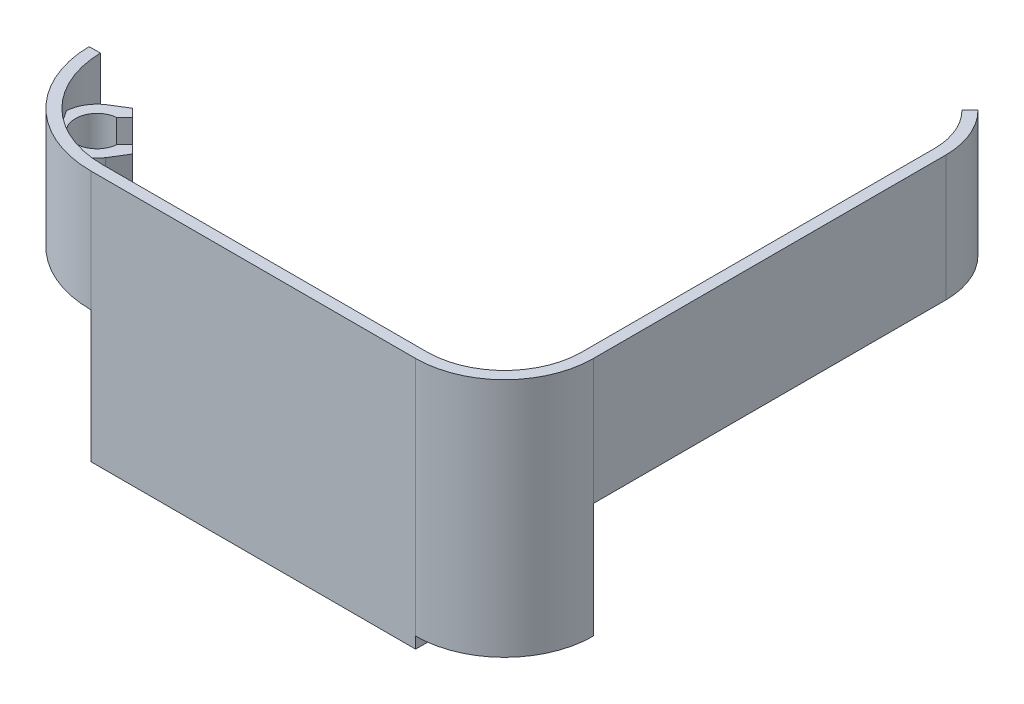
ISO-10303-21;
HEADER;
FILE_DESCRIPTION(('STEP AP214'),'2;1');
FILE_NAME('part.step','',(''),(''),'','','');
FILE_SCHEMA(('AUTOMOTIVE_DESIGN { 1 0 10303 214 1 1 1 1 }'));
ENDSEC;
DATA;
#1=APPLICATION_CONTEXT('core data for automotive mechanical design processes');
#2=APPLICATION_PROTOCOL_DEFINITION('international standard','automotive_design',2000,#1);
#3=PRODUCT_CONTEXT('',#1,'mechanical');
#4=PRODUCT('Part','Part','',(#3));
#5=PRODUCT_RELATED_PRODUCT_CATEGORY('part','',(#4));
#6=PRODUCT_DEFINITION_FORMATION('','',#4);
#7=PRODUCT_DEFINITION_CONTEXT('part definition',#1,'design');
#8=PRODUCT_DEFINITION('design','',#6,#7);
#9=PRODUCT_DEFINITION_SHAPE('','',#8);
#10=(LENGTH_UNIT() NAMED_UNIT(*) SI_UNIT(.MILLI.,.METRE.));
#11=(NAMED_UNIT(*) PLANE_ANGLE_UNIT() SI_UNIT($,.RADIAN.));
#12=(NAMED_UNIT(*) SI_UNIT($,.STERADIAN.) SOLID_ANGLE_UNIT());
#13=UNCERTAINTY_MEASURE_WITH_UNIT(LENGTH_MEASURE(1.E-05),#10,'distance_accuracy_value','');
#14=(GEOMETRIC_REPRESENTATION_CONTEXT(3) GLOBAL_UNCERTAINTY_ASSIGNED_CONTEXT((#13)) GLOBAL_UNIT_ASSIGNED_CONTEXT((#10,
#11,#12)) REPRESENTATION_CONTEXT('',''));
#15=CARTESIAN_POINT('',(0.,0.,0.));
#16=DIRECTION('',(0.,0.,1.));
#17=DIRECTION('',(1.,0.,0.));
#18=AXIS2_PLACEMENT_3D('',#15,#16,#17);
#19=CARTESIAN_POINT('',(72.898,0.,4.4323));
#20=DIRECTION('',(0.,1.,0.));
#21=DIRECTION('',(1.,0.,0.));
#22=AXIS2_PLACEMENT_3D('',#19,#20,#21);
#23=PLANE('',#22);
#24=DIRECTION('',(0.,0.,1.));
#25=VECTOR('',#24,1.);
#26=CARTESIAN_POINT('',(72.898,0.,24.384));
#27=LINE('',#26,#25);
#28=CARTESIAN_POINT('',(72.898,0.,21.844));
#29=VERTEX_POINT('',#28);
#30=CARTESIAN_POINT('',(72.898,0.,24.384));
#31=VERTEX_POINT('',#30);
#32=EDGE_CURVE('E11',#29,#31,#27,.T.);
#33=ORIENTED_EDGE('',*,*,#32,.F.);
#34=CARTESIAN_POINT('',(72.898,0.,4.4323));
#35=DIRECTION('',(0.,1.,0.));
#36=DIRECTION('',(0.,0.,1.));
#37=AXIS2_PLACEMENT_3D('',#34,#35,#36);
#38=CIRCLE('',#37,17.4117);
#39=CARTESIAN_POINT('',(90.3097,0.,4.4323));
#40=VERTEX_POINT('',#39);
#41=EDGE_CURVE('E472',#29,#40,#38,.T.);
#42=ORIENTED_EDGE('',*,*,#41,.T.);
#43=DIRECTION('',(1.,0.,0.));
#44=VECTOR('',#43,1.);
#45=CARTESIAN_POINT('',(90.3097,0.,4.4323));
#46=LINE('',#45,#44);
#47=CARTESIAN_POINT('',(92.8497,0.,4.4323));
#48=VERTEX_POINT('',#47);
#49=EDGE_CURVE('E468',#40,#48,#46,.T.);
#50=ORIENTED_EDGE('',*,*,#49,.T.);
#51=CARTESIAN_POINT('',(72.898,0.,4.4323));
#52=DIRECTION('',(0.,1.,0.));
#53=DIRECTION('',(1.,0.,0.));
#54=AXIS2_PLACEMENT_3D('',#51,#52,#53);
#55=CIRCLE('',#54,19.9517);
#56=EDGE_CURVE('E437',#31,#48,#55,.T.);
#57=ORIENTED_EDGE('',*,*,#56,.F.);
#58=EDGE_LOOP('',(#33,#42,#50,#57));
#59=FACE_BOUND('',#58,.T.);
#60=ADVANCED_FACE('F39',(#59),#23,.F.);
#61=CARTESIAN_POINT('',(90.3097,53.975,4.4323));
#62=DIRECTION('',(0.,0.,-1.));
#63=DIRECTION('',(-1.,0.,0.));
#64=AXIS2_PLACEMENT_3D('',#61,#62,#63);
#65=PLANE('',#64);
#66=DIRECTION('',(0.,-1.,0.));
#67=VECTOR('',#66,1.);
#68=CARTESIAN_POINT('',(90.3097,53.975,4.4323));
#69=LINE('',#68,#67);
#70=CARTESIAN_POINT('',(90.3097,25.781,4.4323));
#71=VERTEX_POINT('',#70);
#72=EDGE_CURVE('E62',#71,#40,#69,.T.);
#73=ORIENTED_EDGE('',*,*,#72,.F.);
#74=DIRECTION('',(1.,0.,0.));
#75=VECTOR('',#74,1.);
#76=CARTESIAN_POINT('',(90.3097,25.781,4.4323));
#77=LINE('',#76,#75);
#78=CARTESIAN_POINT('',(92.8497,25.781,4.4323));
#79=VERTEX_POINT('',#78);
#80=EDGE_CURVE('E57',#71,#79,#77,.T.);
#81=ORIENTED_EDGE('',*,*,#80,.T.);
#82=DIRECTION('',(0.,-1.,0.));
#83=VECTOR('',#82,1.);
#84=CARTESIAN_POINT('',(92.8497,53.975,4.4323));
#85=LINE('',#84,#83);
#86=EDGE_CURVE('E505',#79,#48,#85,.T.);
#87=ORIENTED_EDGE('',*,*,#86,.T.);
#88=ORIENTED_EDGE('',*,*,#49,.F.);
#89=EDGE_LOOP('',(#73,#81,#87,#88));
#90=FACE_BOUND('',#89,.T.);
#91=ADVANCED_FACE('F571',(#90),#65,.T.);
#92=CARTESIAN_POINT('',(0.,53.975,0.));
#93=DIRECTION('',(0.,-1.,0.));
#94=DIRECTION('',(0.,0.,-1.));
#95=AXIS2_PLACEMENT_3D('',#92,#93,#94);
#96=CYLINDRICAL_SURFACE('',#95,21.844);
#97=CARTESIAN_POINT('',(0.,26.9875,0.));
#98=DIRECTION('',(0.,1.,0.));
#99=DIRECTION('',(0.,0.,1.));
#100=AXIS2_PLACEMENT_3D('',#97,#98,#99);
#101=CIRCLE('',#100,21.844);
#102=CARTESIAN_POINT('',(-21.8406730529962,26.9875,0.381230366215898));
#103=VERTEX_POINT('',#102);
#104=CARTESIAN_POINT('',(0.,26.9875,21.844));
#105=VERTEX_POINT('',#104);
#106=EDGE_CURVE('E332',#103,#105,#101,.T.);
#107=ORIENTED_EDGE('',*,*,#106,.F.);
#108=DIRECTION('',(0.,-1.,0.));
#109=VECTOR('',#108,1.);
#110=CARTESIAN_POINT('',(-21.8406730529962,53.975,0.381230366215963));
#111=LINE('',#110,#109);
#112=CARTESIAN_POINT('',(-21.8406730529962,53.975,0.381230366215963));
#113=VERTEX_POINT('',#112);
#114=EDGE_CURVE('E490',#113,#103,#111,.T.);
#115=ORIENTED_EDGE('',*,*,#114,.F.);
#116=CARTESIAN_POINT('',(0.,53.975,0.));
#117=DIRECTION('',(0.,1.,0.));
#118=DIRECTION('',(0.,0.,-1.));
#119=AXIS2_PLACEMENT_3D('',#116,#117,#118);
#120=CIRCLE('',#119,21.844);
#121=CARTESIAN_POINT('',(0.,53.975,21.844));
#122=VERTEX_POINT('',#121);
#123=EDGE_CURVE('E450',#113,#122,#120,.T.);
#124=ORIENTED_EDGE('',*,*,#123,.T.);
#125=DIRECTION('',(0.,-1.,0.));
#126=VECTOR('',#125,1.);
#127=CARTESIAN_POINT('',(0.,53.975,21.844));
#128=LINE('',#127,#126);
#129=EDGE_CURVE('E494',#122,#105,#128,.T.);
#130=ORIENTED_EDGE('',*,*,#129,.T.);
#131=EDGE_LOOP('',(#107,#115,#124,#130));
#132=FACE_BOUND('',#131,.T.);
#133=DIRECTION('',(0.,-1.,0.));
#134=VECTOR('',#133,1.);
#135=CARTESIAN_POINT('',(-10.9598628470482,49.53,18.8955482157541));
#136=LINE('',#135,#134);
#137=CARTESIAN_POINT('',(-10.9598628470484,49.53,18.8955482157541));
#138=VERTEX_POINT('',#137);
#139=CARTESIAN_POINT('',(-10.9598628470484,30.48,18.8955482157541));
#140=VERTEX_POINT('',#139);
#141=EDGE_CURVE('E430',#138,#140,#136,.T.);
#142=ORIENTED_EDGE('',*,*,#141,.F.);
#143=CARTESIAN_POINT('',(0.,49.53,0.));
#144=DIRECTION('',(0.,1.,0.));
#145=DIRECTION('',(0.,0.,-1.));
#146=AXIS2_PLACEMENT_3D('',#143,#144,#145);
#147=CIRCLE('',#146,21.8439999999999);
#148=CARTESIAN_POINT('',(-18.8955482157542,49.53,10.9598628470482));
#149=VERTEX_POINT('',#148);
#150=EDGE_CURVE('E340',#149,#138,#147,.T.);
#151=ORIENTED_EDGE('',*,*,#150,.F.);
#152=DIRECTION('',(0.,-1.,0.));
#153=VECTOR('',#152,1.);
#154=CARTESIAN_POINT('',(-18.8955482157542,49.53,10.9598628470481));
#155=LINE('',#154,#153);
#156=CARTESIAN_POINT('',(-18.8955482157542,30.48,10.9598628470481));
#157=VERTEX_POINT('',#156);
#158=EDGE_CURVE('E434',#149,#157,#155,.T.);
#159=ORIENTED_EDGE('',*,*,#158,.T.);
#160=CARTESIAN_POINT('',(0.,30.48,0.));
#161=DIRECTION('',(0.,1.,0.));
#162=DIRECTION('',(0.,0.,-1.));
#163=AXIS2_PLACEMENT_3D('',#160,#161,#162);
#164=CIRCLE('',#163,21.8439999999999);
#165=EDGE_CURVE('E373',#157,#140,#164,.T.);
#166=ORIENTED_EDGE('',*,*,#165,.T.);
#167=EDGE_LOOP('',(#142,#151,#159,#166));
#168=FACE_BOUND('',#167,.T.);
#169=ADVANCED_FACE('F531',(#132,#168),#96,.F.);
#170=CARTESIAN_POINT('',(72.898,53.975,4.4323));
#171=DIRECTION('',(0.,-1.,0.));
#172=DIRECTION('',(0.,0.,-1.));
#173=AXIS2_PLACEMENT_3D('',#170,#171,#172);
#174=CYLINDRICAL_SURFACE('',#173,19.9517);
#175=ORIENTED_EDGE('',*,*,#56,.T.);
#176=ORIENTED_EDGE('',*,*,#86,.F.);
#177=CARTESIAN_POINT('',(92.8497,53.975,4.4323));
#178=VERTEX_POINT('',#177);
#179=EDGE_CURVE('E506',#178,#79,#85,.T.);
#180=ORIENTED_EDGE('',*,*,#179,.F.);
#181=CARTESIAN_POINT('',(72.898,53.975,4.4323));
#182=DIRECTION('',(0.,1.,0.));
#183=DIRECTION('',(1.,0.,0.));
#184=AXIS2_PLACEMENT_3D('',#181,#182,#183);
#185=CIRCLE('',#184,19.9517);
#186=CARTESIAN_POINT('',(72.898,53.975,24.384));
#187=VERTEX_POINT('',#186);
#188=EDGE_CURVE('E438',#187,#178,#185,.T.);
#189=ORIENTED_EDGE('',*,*,#188,.F.);
#190=DIRECTION('',(0.,-1.,0.));
#191=VECTOR('',#190,1.);
#192=CARTESIAN_POINT('',(72.898,53.975,24.384));
#193=LINE('',#192,#191);
#194=EDGE_CURVE('E464',#187,#31,#193,.T.);
#195=ORIENTED_EDGE('',*,*,#194,.T.);
#196=EDGE_LOOP('',(#175,#176,#180,#189,#195));
#197=FACE_BOUND('',#196,.T.);
#198=ADVANCED_FACE('F41',(#197),#174,.T.);
#199=CARTESIAN_POINT('',(72.898,53.975,4.4323));
#200=DIRECTION('',(0.,-1.,0.));
#201=DIRECTION('',(0.,0.,-1.));
#202=AXIS2_PLACEMENT_3D('',#199,#200,#201);
#203=CYLINDRICAL_SURFACE('',#202,17.4117);
#204=ORIENTED_EDGE('',*,*,#41,.F.);
#205=DIRECTION('',(0.,-1.,0.));
#206=VECTOR('',#205,1.);
#207=CARTESIAN_POINT('',(72.898,53.975,21.844));
#208=LINE('',#207,#206);
#209=CARTESIAN_POINT('',(72.898,53.975,21.844));
#210=VERTEX_POINT('',#209);
#211=EDGE_CURVE('E498',#210,#29,#208,.T.);
#212=ORIENTED_EDGE('',*,*,#211,.F.);
#213=CARTESIAN_POINT('',(72.898,53.975,4.4323));
#214=DIRECTION('',(0.,1.,0.));
#215=DIRECTION('',(0.,0.,1.));
#216=AXIS2_PLACEMENT_3D('',#213,#214,#215);
#217=CIRCLE('',#216,17.4117);
#218=CARTESIAN_POINT('',(90.3097,53.975,4.4323));
#219=VERTEX_POINT('',#218);
#220=EDGE_CURVE('E442',#210,#219,#217,.T.);
#221=ORIENTED_EDGE('',*,*,#220,.T.);
#222=EDGE_CURVE('E502',#219,#71,#69,.T.);
#223=ORIENTED_EDGE('',*,*,#222,.T.);
#224=ORIENTED_EDGE('',*,*,#72,.T.);
#225=EDGE_LOOP('',(#204,#212,#221,#223,#224));
#226=FACE_BOUND('',#225,.T.);
#227=ADVANCED_FACE('F546',(#226),#203,.F.);
#228=CARTESIAN_POINT('',(0.,53.975,21.844));
#229=DIRECTION('',(0.,0.,-1.));
#230=DIRECTION('',(-1.,0.,0.));
#231=AXIS2_PLACEMENT_3D('',#228,#229,#230);
#232=PLANE('',#231);
#233=DIRECTION('',(1.,0.,0.));
#234=VECTOR('',#233,1.);
#235=CARTESIAN_POINT('',(0.,0.,21.844));
#236=LINE('',#235,#234);
#237=CARTESIAN_POINT('',(0.,0.,21.844));
#238=VERTEX_POINT('',#237);
#239=EDGE_CURVE('E443',#238,#29,#236,.T.);
#240=ORIENTED_EDGE('',*,*,#239,.F.);
#241=DIRECTION('',(0.,-1.,0.));
#242=VECTOR('',#241,1.);
#243=CARTESIAN_POINT('',(0.,53.975,21.844));
#244=LINE('',#243,#242);
#245=EDGE_CURVE('E325',#105,#238,#244,.T.);
#246=ORIENTED_EDGE('',*,*,#245,.F.);
#247=ORIENTED_EDGE('',*,*,#129,.F.);
#248=DIRECTION('',(1.,0.,0.));
#249=VECTOR('',#248,1.);
#250=CARTESIAN_POINT('',(0.,53.975,21.844));
#251=LINE('',#250,#249);
#252=EDGE_CURVE('E446',#122,#210,#251,.T.);
#253=ORIENTED_EDGE('',*,*,#252,.T.);
#254=ORIENTED_EDGE('',*,*,#211,.T.);
#255=EDGE_LOOP('',(#240,#246,#247,#253,#254));
#256=FACE_BOUND('',#255,.T.);
#257=ADVANCED_FACE('F538',(#256),#232,.T.);
#258=CARTESIAN_POINT('',(-24.3802861986934,53.975,0.425559478566648));
#259=DIRECTION('',(-0.0174524064372779,0.,-0.999847695156391));
#260=DIRECTION('',(-0.999847695156391,0.,0.0174524064372779));
#261=AXIS2_PLACEMENT_3D('',#258,#259,#260);
#262=PLANE('',#261);
#263=DIRECTION('',(0.999847695156391,0.,-0.0174524064372779));
#264=VECTOR('',#263,1.);
#265=CARTESIAN_POINT('',(-0.381172302984591,26.9875,0.00665338729743212));
#266=LINE('',#265,#264);
#267=CARTESIAN_POINT('',(-24.3802861986934,26.9875,0.425559478566584));
#268=VERTEX_POINT('',#267);
#269=EDGE_CURVE('E306',#268,#103,#266,.T.);
#270=ORIENTED_EDGE('',*,*,#269,.F.);
#271=DIRECTION('',(0.,-1.,0.));
#272=VECTOR('',#271,1.);
#273=CARTESIAN_POINT('',(-24.3802861986934,53.975,0.425559478566648));
#274=LINE('',#273,#272);
#275=CARTESIAN_POINT('',(-24.3802861986934,53.975,0.425559478566648));
#276=VERTEX_POINT('',#275);
#277=EDGE_CURVE('E486',#276,#268,#274,.T.);
#278=ORIENTED_EDGE('',*,*,#277,.F.);
#279=DIRECTION('',(0.999847695156391,0.,-0.0174524064372779));
#280=VECTOR('',#279,1.);
#281=CARTESIAN_POINT('',(-24.3802861986934,53.975,0.425559478566648));
#282=LINE('',#281,#280);
#283=EDGE_CURVE('E454',#276,#113,#282,.T.);
#284=ORIENTED_EDGE('',*,*,#283,.T.);
#285=ORIENTED_EDGE('',*,*,#114,.T.);
#286=EDGE_LOOP('',(#270,#278,#284,#285));
#287=FACE_BOUND('',#286,.T.);
#288=ADVANCED_FACE('F528',(#287),#262,.T.);
#289=CARTESIAN_POINT('',(0.,53.975,0.));
#290=DIRECTION('',(0.,-1.,0.));
#291=DIRECTION('',(0.,0.,-1.));
#292=AXIS2_PLACEMENT_3D('',#289,#290,#291);
#293=CYLINDRICAL_SURFACE('',#292,24.384);
#294=ORIENTED_EDGE('',*,*,#277,.T.);
#295=CARTESIAN_POINT('',(0.,26.9875,0.));
#296=DIRECTION('',(0.,1.,0.));
#297=DIRECTION('',(0.,0.,1.));
#298=AXIS2_PLACEMENT_3D('',#295,#296,#297);
#299=CIRCLE('',#298,24.384);
#300=CARTESIAN_POINT('',(0.,26.9875,24.384));
#301=VERTEX_POINT('',#300);
#302=EDGE_CURVE('E328',#268,#301,#299,.T.);
#303=ORIENTED_EDGE('',*,*,#302,.T.);
#304=DIRECTION('',(0.,-1.,0.));
#305=VECTOR('',#304,1.);
#306=CARTESIAN_POINT('',(0.,53.975,24.384));
#307=LINE('',#306,#305);
#308=CARTESIAN_POINT('',(0.,53.975,24.384));
#309=VERTEX_POINT('',#308);
#310=EDGE_CURVE('E482',#309,#301,#307,.T.);
#311=ORIENTED_EDGE('',*,*,#310,.F.);
#312=CARTESIAN_POINT('',(0.,53.975,0.));
#313=DIRECTION('',(0.,1.,0.));
#314=DIRECTION('',(1.,0.,0.));
#315=AXIS2_PLACEMENT_3D('',#312,#313,#314);
#316=CIRCLE('',#315,24.384);
#317=EDGE_CURVE('E458',#276,#309,#316,.T.);
#318=ORIENTED_EDGE('',*,*,#317,.F.);
#319=EDGE_LOOP('',(#294,#303,#311,#318));
#320=FACE_BOUND('',#319,.T.);
#321=ADVANCED_FACE('F524',(#320),#293,.T.);
#322=CARTESIAN_POINT('',(0.,53.975,24.384));
#323=DIRECTION('',(0.,0.,-1.));
#324=DIRECTION('',(-1.,0.,0.));
#325=AXIS2_PLACEMENT_3D('',#322,#323,#324);
#326=PLANE('',#325);
#327=DIRECTION('',(1.,0.,0.));
#328=VECTOR('',#327,1.);
#329=CARTESIAN_POINT('',(0.,26.9875,24.384));
#330=LINE('',#329,#328);
#331=CARTESIAN_POINT('',(0.0443358649176609,26.9875,24.384));
#332=VERTEX_POINT('',#331);
#333=EDGE_CURVE('E43',#301,#332,#330,.T.);
#334=ORIENTED_EDGE('',*,*,#333,.T.);
#335=DIRECTION('',(0.,-1.,0.));
#336=VECTOR('',#335,1.);
#337=CARTESIAN_POINT('',(0.0443358649176642,53.975,24.384));
#338=LINE('',#337,#336);
#339=CARTESIAN_POINT('',(0.0443358649176569,0.,24.384));
#340=VERTEX_POINT('',#339);
#341=EDGE_CURVE('E321',#332,#340,#338,.T.);
#342=ORIENTED_EDGE('',*,*,#341,.T.);
#343=DIRECTION('',(-1.,0.,0.));
#344=VECTOR('',#343,1.);
#345=CARTESIAN_POINT('',(72.898,0.,24.384));
#346=LINE('',#345,#344);
#347=CARTESIAN_POINT('',(0.,0.,24.384));
#348=VERTEX_POINT('',#347);
#349=EDGE_CURVE('E582',#340,#348,#346,.T.);
#350=ORIENTED_EDGE('',*,*,#349,.T.);
#351=DIRECTION('',(0.,1.,0.));
#352=VECTOR('',#351,1.);
#353=CARTESIAN_POINT('',(0.,-2.54,24.384));
#354=LINE('',#353,#352);
#355=CARTESIAN_POINT('',(0.,-2.54,24.384));
#356=VERTEX_POINT('',#355);
#357=EDGE_CURVE('E234',#356,#348,#354,.T.);
#358=ORIENTED_EDGE('',*,*,#357,.F.);
#359=DIRECTION('',(-1.,0.,0.));
#360=VECTOR('',#359,1.);
#361=CARTESIAN_POINT('',(72.898,-2.54,24.384));
#362=LINE('',#361,#360);
#363=CARTESIAN_POINT('',(72.898,-2.54,24.384));
#364=VERTEX_POINT('',#363);
#365=EDGE_CURVE('E226',#364,#356,#362,.T.);
#366=ORIENTED_EDGE('',*,*,#365,.F.);
#367=DIRECTION('',(0.,1.,0.));
#368=VECTOR('',#367,1.);
#369=CARTESIAN_POINT('',(72.898,-2.54,24.384));
#370=LINE('',#369,#368);
#371=EDGE_CURVE('E232',#364,#31,#370,.T.);
#372=ORIENTED_EDGE('',*,*,#371,.T.);
#373=ORIENTED_EDGE('',*,*,#194,.F.);
#374=DIRECTION('',(1.,0.,0.));
#375=VECTOR('',#374,1.);
#376=CARTESIAN_POINT('',(0.,53.975,24.384));
#377=LINE('',#376,#375);
#378=EDGE_CURVE('E461',#309,#187,#377,.T.);
#379=ORIENTED_EDGE('',*,*,#378,.F.);
#380=ORIENTED_EDGE('',*,*,#310,.T.);
#381=EDGE_LOOP('',(#334,#342,#350,#358,#366,#372,#373,#379,#380));
#382=FACE_BOUND('',#381,.T.);
#383=ADVANCED_FACE('F229',(#382),#326,.F.);
#384=CARTESIAN_POINT('',(72.898,53.975,4.4323));
#385=DIRECTION('',(0.,1.,0.));
#386=DIRECTION('',(1.,0.,0.));
#387=AXIS2_PLACEMENT_3D('',#384,#385,#386);
#388=PLANE('',#387);
#389=ORIENTED_EDGE('',*,*,#188,.T.);
#390=DIRECTION('',(0.,0.,-1.));
#391=VECTOR('',#390,1.);
#392=CARTESIAN_POINT('',(92.8497,53.975,4.4323));
#393=LINE('',#392,#391);
#394=CARTESIAN_POINT('',(92.8497,53.975,-74.676));
#395=VERTEX_POINT('',#394);
#396=EDGE_CURVE('E259',#178,#395,#393,.T.);
#397=ORIENTED_EDGE('',*,*,#396,.T.);
#398=CARTESIAN_POINT('',(75.4100599999958,53.975,-74.676));
#399=DIRECTION('',(0.,1.,0.));
#400=DIRECTION('',(0.,0.,1.));
#401=AXIS2_PLACEMENT_3D('',#398,#399,#400);
#402=CIRCLE('',#401,17.4396400000042);
#403=CARTESIAN_POINT('',(87.741747705451,53.975,-87.0076877054551));
#404=VERTEX_POINT('',#403);
#405=EDGE_CURVE('E292',#395,#404,#402,.T.);
#406=ORIENTED_EDGE('',*,*,#405,.T.);
#407=DIRECTION('',(-0.70710678118649,0.,0.707106781186605));
#408=VECTOR('',#407,1.);
#409=CARTESIAN_POINT('',(85.9456964812373,53.975,-85.2116364812411));
#410=LINE('',#409,#408);
#411=CARTESIAN_POINT('',(85.9456964812373,53.975,-85.2116364812411));
#412=VERTEX_POINT('',#411);
#413=EDGE_CURVE('E296',#404,#412,#410,.T.);
#414=ORIENTED_EDGE('',*,*,#413,.T.);
#415=CARTESIAN_POINT('',(75.4100599999958,53.975,-74.676));
#416=DIRECTION('',(0.,-1.,0.));
#417=DIRECTION('',(0.,0.,1.));
#418=AXIS2_PLACEMENT_3D('',#415,#416,#417);
#419=CIRCLE('',#418,14.8996400000042);
#420=CARTESIAN_POINT('',(90.3097,53.975,-74.676));
#421=VERTEX_POINT('',#420);
#422=EDGE_CURVE('E269',#412,#421,#419,.T.);
#423=ORIENTED_EDGE('',*,*,#422,.T.);
#424=DIRECTION('',(0.,0.,1.));
#425=VECTOR('',#424,1.);
#426=CARTESIAN_POINT('',(90.3097,53.975,4.4323));
#427=LINE('',#426,#425);
#428=EDGE_CURVE('E254',#421,#219,#427,.T.);
#429=ORIENTED_EDGE('',*,*,#428,.T.);
#430=ORIENTED_EDGE('',*,*,#220,.F.);
#431=ORIENTED_EDGE('',*,*,#252,.F.);
#432=ORIENTED_EDGE('',*,*,#123,.F.);
#433=ORIENTED_EDGE('',*,*,#283,.F.);
#434=ORIENTED_EDGE('',*,*,#317,.T.);
#435=ORIENTED_EDGE('',*,*,#378,.T.);
#436=EDGE_LOOP('',(#389,#397,#406,#414,#423,#429,#430,#431,#432,#433,#434,#435));
#437=FACE_BOUND('',#436,.T.);
#438=ADVANCED_FACE('F541',(#437),#388,.T.);
#439=CARTESIAN_POINT('',(-11.498319937417,49.53,11.4983199374169));
#440=DIRECTION('',(0.,-1.,0.));
#441=DIRECTION('',(0.,0.,-1.));
#442=AXIS2_PLACEMENT_3D('',#439,#440,#441);
#443=CYLINDRICAL_SURFACE('',#442,7.4168);
#444=CARTESIAN_POINT('',(-11.498319937417,30.48,11.4983199374169));
#445=DIRECTION('',(0.,1.,0.));
#446=DIRECTION('',(0.,0.,-1.));
#447=AXIS2_PLACEMENT_3D('',#444,#445,#446);
#448=CIRCLE('',#447,7.4168);
#449=CARTESIAN_POINT('',(-15.6962117445499,30.48,5.38385948570027));
#450=VERTEX_POINT('',#449);
#451=EDGE_CURVE('E335',#450,#157,#448,.T.);
#452=ORIENTED_EDGE('',*,*,#451,.T.);
#453=ORIENTED_EDGE('',*,*,#158,.F.);
#454=CARTESIAN_POINT('',(-11.498319937417,49.53,11.4983199374169));
#455=DIRECTION('',(0.,1.,0.));
#456=DIRECTION('',(0.,0.,-1.));
#457=AXIS2_PLACEMENT_3D('',#454,#455,#456);
#458=CIRCLE('',#457,7.4168);
#459=CARTESIAN_POINT('',(-15.6962117445499,49.53,5.38385948570027));
#460=VERTEX_POINT('',#459);
#461=EDGE_CURVE('E336',#460,#149,#458,.T.);
#462=ORIENTED_EDGE('',*,*,#461,.F.);
#463=DIRECTION('',(0.,-1.,0.));
#464=VECTOR('',#463,1.);
#465=CARTESIAN_POINT('',(-15.6962117445499,49.53,5.38385948570027));
#466=LINE('',#465,#464);
#467=EDGE_CURVE('E369',#460,#450,#466,.T.);
#468=ORIENTED_EDGE('',*,*,#467,.T.);
#469=EDGE_LOOP('',(#452,#453,#462,#468));
#470=FACE_BOUND('',#469,.T.);
#471=ADVANCED_FACE('F790',(#470),#443,.T.);
#472=CARTESIAN_POINT('',(-11.498319937417,49.53,11.4983199374169));
#473=DIRECTION('',(0.,-1.,0.));
#474=DIRECTION('',(0.,0.,-1.));
#475=AXIS2_PLACEMENT_3D('',#472,#473,#474);
#476=CYLINDRICAL_SURFACE('',#475,7.4168);
#477=CARTESIAN_POINT('',(-11.498319937417,30.48,11.4983199374169));
#478=DIRECTION('',(0.,1.,0.));
#479=DIRECTION('',(0.,0.,1.));
#480=AXIS2_PLACEMENT_3D('',#477,#478,#479);
#481=CIRCLE('',#480,7.4168);
#482=CARTESIAN_POINT('',(-5.3838594857004,30.48,15.6962117445498));
#483=VERTEX_POINT('',#482);
#484=EDGE_CURVE('E376',#140,#483,#481,.T.);
#485=ORIENTED_EDGE('',*,*,#484,.T.);
#486=DIRECTION('',(0.,-1.,0.));
#487=VECTOR('',#486,1.);
#488=CARTESIAN_POINT('',(-5.3838594857004,49.53,15.6962117445498));
#489=LINE('',#488,#487);
#490=CARTESIAN_POINT('',(-5.3838594857004,49.53,15.6962117445498));
#491=VERTEX_POINT('',#490);
#492=EDGE_CURVE('E426',#491,#483,#489,.T.);
#493=ORIENTED_EDGE('',*,*,#492,.F.);
#494=CARTESIAN_POINT('',(-11.498319937417,49.53,11.4983199374169));
#495=DIRECTION('',(0.,1.,0.));
#496=DIRECTION('',(0.,0.,1.));
#497=AXIS2_PLACEMENT_3D('',#494,#495,#496);
#498=CIRCLE('',#497,7.4168);
#499=EDGE_CURVE('E345',#138,#491,#498,.T.);
#500=ORIENTED_EDGE('',*,*,#499,.F.);
#501=ORIENTED_EDGE('',*,*,#141,.T.);
#502=EDGE_LOOP('',(#485,#493,#500,#501));
#503=FACE_BOUND('',#502,.T.);
#504=ADVANCED_FACE('F787',(#503),#476,.T.);
#505=CARTESIAN_POINT('',(-3.0458511648099,49.53,11.9363529340721));
#506=DIRECTION('',(-0.849204423107518,0.,-0.52806424587793));
#507=DIRECTION('',(-0.52806424587793,0.,0.849204423107518));
#508=AXIS2_PLACEMENT_3D('',#505,#506,#507);
#509=PLANE('',#508);
#510=DIRECTION('',(0.52806424587793,0.,-0.849204423107518));
#511=VECTOR('',#510,1.);
#512=CARTESIAN_POINT('',(-3.0458511648099,30.48,11.9363529340721));
#513=LINE('',#512,#511);
#514=CARTESIAN_POINT('',(-3.0458511648099,30.48,11.9363529340721));
#515=VERTEX_POINT('',#514);
#516=EDGE_CURVE('E379',#483,#515,#513,.T.);
#517=ORIENTED_EDGE('',*,*,#516,.T.);
#518=DIRECTION('',(0.,-1.,0.));
#519=VECTOR('',#518,1.);
#520=CARTESIAN_POINT('',(-3.0458511648099,49.53,11.9363529340721));
#521=LINE('',#520,#519);
#522=CARTESIAN_POINT('',(-3.0458511648099,49.53,11.9363529340721));
#523=VERTEX_POINT('',#522);
#524=EDGE_CURVE('E422',#523,#515,#521,.T.);
#525=ORIENTED_EDGE('',*,*,#524,.F.);
#526=DIRECTION('',(0.52806424587793,0.,-0.849204423107518));
#527=VECTOR('',#526,1.);
#528=CARTESIAN_POINT('',(-3.0458511648099,49.53,11.9363529340721));
#529=LINE('',#528,#527);
#530=EDGE_CURVE('E348',#491,#523,#529,.T.);
#531=ORIENTED_EDGE('',*,*,#530,.F.);
#532=ORIENTED_EDGE('',*,*,#492,.T.);
#533=EDGE_LOOP('',(#517,#525,#531,#532));
#534=FACE_BOUND('',#533,.T.);
#535=ADVANCED_FACE('F783',(#534),#509,.F.);
#536=CARTESIAN_POINT('',(-4.8435414742103,49.53,10.1386626246722));
#537=DIRECTION('',(-0.707106781186456,0.,0.707106781186639));
#538=DIRECTION('',(0.707106781186639,0.,0.707106781186456));
#539=AXIS2_PLACEMENT_3D('',#536,#537,#538);
#540=PLANE('',#539);
#541=DIRECTION('',(-0.707106781186639,0.,-0.707106781186456));
#542=VECTOR('',#541,1.);
#543=CARTESIAN_POINT('',(-4.8435414742103,30.48,10.1386626246722));
#544=LINE('',#543,#542);
#545=CARTESIAN_POINT('',(-4.8435414742103,30.48,10.1386626246722));
#546=VERTEX_POINT('',#545);
#547=EDGE_CURVE('E382',#515,#546,#544,.T.);
#548=ORIENTED_EDGE('',*,*,#547,.T.);
#549=DIRECTION('',(0.,-1.,0.));
#550=VECTOR('',#549,1.);
#551=CARTESIAN_POINT('',(-4.8435414742103,49.53,10.1386626246722));
#552=LINE('',#551,#550);
#553=CARTESIAN_POINT('',(-4.8435414742103,49.53,10.1386626246722));
#554=VERTEX_POINT('',#553);
#555=EDGE_CURVE('E418',#554,#546,#552,.T.);
#556=ORIENTED_EDGE('',*,*,#555,.F.);
#557=DIRECTION('',(-0.707106781186639,0.,-0.707106781186456));
#558=VECTOR('',#557,1.);
#559=CARTESIAN_POINT('',(-4.8435414742103,49.53,10.1386626246722));
#560=LINE('',#559,#558);
#561=EDGE_CURVE('E351',#523,#554,#560,.T.);
#562=ORIENTED_EDGE('',*,*,#561,.F.);
#563=ORIENTED_EDGE('',*,*,#524,.T.);
#564=EDGE_LOOP('',(#548,#556,#562,#563));
#565=FACE_BOUND('',#564,.T.);
#566=ADVANCED_FACE('F779',(#565),#540,.F.);
#567=CARTESIAN_POINT('',(-6.64123178361119,49.53,11.9363529340727));
#568=DIRECTION('',(0.707106781186469,0.,0.707106781186627));
#569=DIRECTION('',(0.707106781186627,0.,-0.707106781186469));
#570=AXIS2_PLACEMENT_3D('',#567,#568,#569);
#571=PLANE('',#570);
#572=DIRECTION('',(-0.707106781186627,0.,0.707106781186469));
#573=VECTOR('',#572,1.);
#574=CARTESIAN_POINT('',(-6.64123178361119,30.48,11.9363529340727));
#575=LINE('',#574,#573);
#576=CARTESIAN_POINT('',(-6.64123178361119,30.48,11.9363529340727));
#577=VERTEX_POINT('',#576);
#578=EDGE_CURVE('E385',#546,#577,#575,.T.);
#579=ORIENTED_EDGE('',*,*,#578,.T.);
#580=DIRECTION('',(0.,-1.,0.));
#581=VECTOR('',#580,1.);
#582=CARTESIAN_POINT('',(-6.64123178361119,49.53,11.9363529340727));
#583=LINE('',#582,#581);
#584=CARTESIAN_POINT('',(-6.64123178361119,49.53,11.9363529340727));
#585=VERTEX_POINT('',#584);
#586=EDGE_CURVE('E414',#585,#577,#583,.T.);
#587=ORIENTED_EDGE('',*,*,#586,.F.);
#588=DIRECTION('',(-0.707106781186627,0.,0.707106781186469));
#589=VECTOR('',#588,1.);
#590=CARTESIAN_POINT('',(-6.64123178361119,49.53,11.9363529340727));
#591=LINE('',#590,#589);
#592=EDGE_CURVE('E354',#554,#585,#591,.T.);
#593=ORIENTED_EDGE('',*,*,#592,.F.);
#594=ORIENTED_EDGE('',*,*,#555,.T.);
#595=EDGE_LOOP('',(#579,#587,#593,#594));
#596=FACE_BOUND('',#595,.T.);
#597=ADVANCED_FACE('F775',(#596),#571,.F.);
#598=CARTESIAN_POINT('',(-11.498319937417,49.53,11.4983199374169));
#599=DIRECTION('',(0.,-1.,0.));
#600=DIRECTION('',(0.,0.,-1.));
#601=AXIS2_PLACEMENT_3D('',#598,#599,#600);
#602=CYLINDRICAL_SURFACE('',#601,4.8768);
#603=CARTESIAN_POINT('',(-11.498319937417,30.48,11.4983199374169));
#604=DIRECTION('',(0.,-1.,0.));
#605=DIRECTION('',(0.,0.,1.));
#606=AXIS2_PLACEMENT_3D('',#603,#604,#605);
#607=CIRCLE('',#606,4.8768);
#608=CARTESIAN_POINT('',(-11.9363529340728,30.48,6.64123178361107));
#609=VERTEX_POINT('',#608);
#610=EDGE_CURVE('E388',#577,#609,#607,.T.);
#611=ORIENTED_EDGE('',*,*,#610,.T.);
#612=DIRECTION('',(0.,-1.,0.));
#613=VECTOR('',#612,1.);
#614=CARTESIAN_POINT('',(-11.9363529340728,49.53,6.64123178361107));
#615=LINE('',#614,#613);
#616=CARTESIAN_POINT('',(-11.9363529340728,49.53,6.64123178361107));
#617=VERTEX_POINT('',#616);
#618=EDGE_CURVE('E410',#617,#609,#615,.T.);
#619=ORIENTED_EDGE('',*,*,#618,.F.);
#620=CARTESIAN_POINT('',(-11.498319937417,49.53,11.4983199374169));
#621=DIRECTION('',(0.,-1.,0.));
#622=DIRECTION('',(0.,0.,1.));
#623=AXIS2_PLACEMENT_3D('',#620,#621,#622);
#624=CIRCLE('',#623,4.8768);
#625=EDGE_CURVE('E357',#585,#617,#624,.T.);
#626=ORIENTED_EDGE('',*,*,#625,.F.);
#627=ORIENTED_EDGE('',*,*,#586,.T.);
#628=EDGE_LOOP('',(#611,#619,#626,#627));
#629=FACE_BOUND('',#628,.T.);
#630=ADVANCED_FACE('F771',(#629),#602,.F.);
#631=CARTESIAN_POINT('',(-11.9363529340728,49.53,6.64123178361107));
#632=DIRECTION('',(-0.707106781186523,0.,-0.707106781186572));
#633=DIRECTION('',(-0.707106781186572,0.,0.707106781186523));
#634=AXIS2_PLACEMENT_3D('',#631,#632,#633);
#635=PLANE('',#634);
#636=DIRECTION('',(0.707106781186572,0.,-0.707106781186523));
#637=VECTOR('',#636,1.);
#638=CARTESIAN_POINT('',(-11.9363529340728,30.48,6.64123178361107));
#639=LINE('',#638,#637);
#640=CARTESIAN_POINT('',(-10.1386626246719,30.48,4.84354147421027));
#641=VERTEX_POINT('',#640);
#642=EDGE_CURVE('E391',#609,#641,#639,.T.);
#643=ORIENTED_EDGE('',*,*,#642,.T.);
#644=DIRECTION('',(0.,-1.,0.));
#645=VECTOR('',#644,1.);
#646=CARTESIAN_POINT('',(-10.1386626246719,49.53,4.84354147421027));
#647=LINE('',#646,#645);
#648=CARTESIAN_POINT('',(-10.1386626246719,49.53,4.84354147421027));
#649=VERTEX_POINT('',#648);
#650=EDGE_CURVE('E406',#649,#641,#647,.T.);
#651=ORIENTED_EDGE('',*,*,#650,.F.);
#652=DIRECTION('',(0.707106781186572,0.,-0.707106781186523));
#653=VECTOR('',#652,1.);
#654=CARTESIAN_POINT('',(-11.9363529340728,49.53,6.64123178361107));
#655=LINE('',#654,#653);
#656=EDGE_CURVE('E360',#617,#649,#655,.T.);
#657=ORIENTED_EDGE('',*,*,#656,.F.);
#658=ORIENTED_EDGE('',*,*,#618,.T.);
#659=EDGE_LOOP('',(#643,#651,#657,#658));
#660=FACE_BOUND('',#659,.T.);
#661=ADVANCED_FACE('F767',(#660),#635,.F.);
#662=CARTESIAN_POINT('',(-10.1386626246719,49.53,4.84354147421027));
#663=DIRECTION('',(-0.707106781186571,0.,0.707106781186524));
#664=DIRECTION('',(0.707106781186524,0.,0.707106781186571));
#665=AXIS2_PLACEMENT_3D('',#662,#663,#664);
#666=PLANE('',#665);
#667=DIRECTION('',(-0.707106781186524,0.,-0.707106781186571));
#668=VECTOR('',#667,1.);
#669=CARTESIAN_POINT('',(-10.1386626246719,30.48,4.84354147421027));
#670=LINE('',#669,#668);
#671=CARTESIAN_POINT('',(-11.9363529340722,30.48,3.04585116480978));
#672=VERTEX_POINT('',#671);
#673=EDGE_CURVE('E394',#641,#672,#670,.T.);
#674=ORIENTED_EDGE('',*,*,#673,.T.);
#675=DIRECTION('',(0.,-1.,0.));
#676=VECTOR('',#675,1.);
#677=CARTESIAN_POINT('',(-11.9363529340722,49.53,3.04585116480978));
#678=LINE('',#677,#676);
#679=CARTESIAN_POINT('',(-11.9363529340722,49.53,3.04585116480978));
#680=VERTEX_POINT('',#679);
#681=EDGE_CURVE('E402',#680,#672,#678,.T.);
#682=ORIENTED_EDGE('',*,*,#681,.F.);
#683=DIRECTION('',(-0.707106781186524,0.,-0.707106781186571));
#684=VECTOR('',#683,1.);
#685=CARTESIAN_POINT('',(-10.1386626246719,49.53,4.84354147421027));
#686=LINE('',#685,#684);
#687=EDGE_CURVE('E363',#649,#680,#686,.T.);
#688=ORIENTED_EDGE('',*,*,#687,.F.);
#689=ORIENTED_EDGE('',*,*,#650,.T.);
#690=EDGE_LOOP('',(#674,#682,#688,#689));
#691=FACE_BOUND('',#690,.T.);
#692=ADVANCED_FACE('F763',(#691),#666,.F.);
#693=CARTESIAN_POINT('',(-11.9363529340722,49.53,3.04585116480978));
#694=DIRECTION('',(0.528064245877929,0.,0.849204423107519));
#695=DIRECTION('',(0.849204423107519,0.,-0.528064245877929));
#696=AXIS2_PLACEMENT_3D('',#693,#694,#695);
#697=PLANE('',#696);
#698=DIRECTION('',(-0.849204423107519,0.,0.528064245877929));
#699=VECTOR('',#698,1.);
#700=CARTESIAN_POINT('',(-11.9363529340722,30.48,3.04585116480978));
#701=LINE('',#700,#699);
#702=EDGE_CURVE('E341',#672,#450,#701,.T.);
#703=ORIENTED_EDGE('',*,*,#702,.T.);
#704=ORIENTED_EDGE('',*,*,#467,.F.);
#705=DIRECTION('',(-0.849204423107519,0.,0.528064245877929));
#706=VECTOR('',#705,1.);
#707=CARTESIAN_POINT('',(-11.9363529340722,49.53,3.04585116480978));
#708=LINE('',#707,#706);
#709=EDGE_CURVE('E366',#680,#460,#708,.T.);
#710=ORIENTED_EDGE('',*,*,#709,.F.);
#711=ORIENTED_EDGE('',*,*,#681,.T.);
#712=EDGE_LOOP('',(#703,#704,#710,#711));
#713=FACE_BOUND('',#712,.T.);
#714=ADVANCED_FACE('F757',(#713),#697,.F.);
#715=CARTESIAN_POINT('',(-11.498319937417,49.53,11.4983199374169));
#716=DIRECTION('',(0.,-1.,0.));
#717=DIRECTION('',(0.,0.,-1.));
#718=AXIS2_PLACEMENT_3D('',#715,#716,#717);
#719=PLANE('',#718);
#720=ORIENTED_EDGE('',*,*,#461,.T.);
#721=ORIENTED_EDGE('',*,*,#150,.T.);
#722=ORIENTED_EDGE('',*,*,#499,.T.);
#723=ORIENTED_EDGE('',*,*,#530,.T.);
#724=ORIENTED_EDGE('',*,*,#561,.T.);
#725=ORIENTED_EDGE('',*,*,#592,.T.);
#726=ORIENTED_EDGE('',*,*,#625,.T.);
#727=ORIENTED_EDGE('',*,*,#656,.T.);
#728=ORIENTED_EDGE('',*,*,#687,.T.);
#729=ORIENTED_EDGE('',*,*,#709,.T.);
#730=EDGE_LOOP('',(#720,#721,#722,#723,#724,#725,#726,#727,#728,#729));
#731=FACE_BOUND('',#730,.T.);
#732=ADVANCED_FACE('F754',(#731),#719,.F.);
#733=CARTESIAN_POINT('',(-11.498319937417,30.48,11.4983199374169));
#734=DIRECTION('',(0.,-1.,0.));
#735=DIRECTION('',(0.,0.,-1.));
#736=AXIS2_PLACEMENT_3D('',#733,#734,#735);
#737=PLANE('',#736);
#738=ORIENTED_EDGE('',*,*,#451,.F.);
#739=ORIENTED_EDGE('',*,*,#702,.F.);
#740=ORIENTED_EDGE('',*,*,#673,.F.);
#741=ORIENTED_EDGE('',*,*,#642,.F.);
#742=ORIENTED_EDGE('',*,*,#610,.F.);
#743=ORIENTED_EDGE('',*,*,#578,.F.);
#744=ORIENTED_EDGE('',*,*,#547,.F.);
#745=ORIENTED_EDGE('',*,*,#516,.F.);
#746=ORIENTED_EDGE('',*,*,#484,.F.);
#747=ORIENTED_EDGE('',*,*,#165,.F.);
#748=EDGE_LOOP('',(#738,#739,#740,#741,#742,#743,#744,#745,#746,#747));
#749=FACE_BOUND('',#748,.T.);
#750=ADVANCED_FACE('F663',(#749),#737,.T.);
#751=CARTESIAN_POINT('',(0.0726031250746801,26.9875,26.0034302498028));
#752=DIRECTION('',(0.,1.,0.));
#753=DIRECTION('',(0.,0.,1.));
#754=AXIS2_PLACEMENT_3D('',#751,#752,#753);
#755=PLANE('',#754);
#756=ORIENTED_EDGE('',*,*,#106,.T.);
#757=DIRECTION('',(-0.0174524064372779,0.,-0.999847695156391));
#758=VECTOR('',#757,1.);
#759=CARTESIAN_POINT('',(0.0726031250746801,26.9875,26.0034302498028));
#760=LINE('',#759,#758);
#761=EDGE_CURVE('E317',#332,#105,#760,.T.);
#762=ORIENTED_EDGE('',*,*,#761,.F.);
#763=ORIENTED_EDGE('',*,*,#333,.F.);
#764=ORIENTED_EDGE('',*,*,#302,.F.);
#765=ORIENTED_EDGE('',*,*,#269,.T.);
#766=EDGE_LOOP('',(#756,#762,#763,#764,#765));
#767=FACE_BOUND('',#766,.T.);
#768=ADVANCED_FACE('F521',(#767),#755,.F.);
#769=CARTESIAN_POINT('',(0.0726031250746801,26.9875,26.0034302498028));
#770=DIRECTION('',(0.999847695156391,0.,-0.0174524064372779));
#771=DIRECTION('',(-0.0174524064372779,0.,-0.999847695156391));
#772=AXIS2_PLACEMENT_3D('',#769,#770,#771);
#773=PLANE('',#772);
#774=ORIENTED_EDGE('',*,*,#245,.T.);
#775=DIRECTION('',(-0.0174524064372779,0.,-0.999847695156391));
#776=VECTOR('',#775,1.);
#777=CARTESIAN_POINT('',(-0.281626037386407,0.,5.70965512390485));
#778=LINE('',#777,#776);
#779=EDGE_CURVE('E509',#340,#238,#778,.T.);
#780=ORIENTED_EDGE('',*,*,#779,.F.);
#781=ORIENTED_EDGE('',*,*,#341,.F.);
#782=ORIENTED_EDGE('',*,*,#761,.T.);
#783=EDGE_LOOP('',(#774,#780,#781,#782));
#784=FACE_BOUND('',#783,.T.);
#785=ADVANCED_FACE('F662',(#784),#773,.F.);
#786=CARTESIAN_POINT('',(90.3097,25.781,4.4323));
#787=DIRECTION('',(-1.,0.,0.));
#788=DIRECTION('',(0.,0.,1.));
#789=AXIS2_PLACEMENT_3D('',#786,#787,#788);
#790=PLANE('',#789);
#791=ORIENTED_EDGE('',*,*,#428,.F.);
#792=DIRECTION('',(0.,1.,0.));
#793=VECTOR('',#792,1.);
#794=CARTESIAN_POINT('',(90.3097,25.781,-74.676));
#795=LINE('',#794,#793);
#796=CARTESIAN_POINT('',(90.3097,25.781,-74.676));
#797=VERTEX_POINT('',#796);
#798=EDGE_CURVE('E303',#797,#421,#795,.T.);
#799=ORIENTED_EDGE('',*,*,#798,.F.);
#800=DIRECTION('',(0.,0.,1.));
#801=VECTOR('',#800,1.);
#802=CARTESIAN_POINT('',(90.3097,25.781,4.4323));
#803=LINE('',#802,#801);
#804=EDGE_CURVE('E265',#797,#71,#803,.T.);
#805=ORIENTED_EDGE('',*,*,#804,.T.);
#806=ORIENTED_EDGE('',*,*,#222,.F.);
#807=EDGE_LOOP('',(#791,#799,#805,#806));
#808=FACE_BOUND('',#807,.T.);
#809=ADVANCED_FACE('F548',(#808),#790,.T.);
#810=CARTESIAN_POINT('',(75.4100599999958,25.781,-74.676));
#811=DIRECTION('',(0.,1.,0.));
#812=DIRECTION('',(0.,0.,1.));
#813=AXIS2_PLACEMENT_3D('',#810,#811,#812);
#814=CYLINDRICAL_SURFACE('',#813,14.8996400000042);
#815=ORIENTED_EDGE('',*,*,#422,.F.);
#816=DIRECTION('',(0.,1.,0.));
#817=VECTOR('',#816,1.);
#818=CARTESIAN_POINT('',(85.9456964812373,25.781,-85.2116364812411));
#819=LINE('',#818,#817);
#820=CARTESIAN_POINT('',(85.9456964812373,25.781,-85.2116364812411));
#821=VERTEX_POINT('',#820);
#822=EDGE_CURVE('E307',#821,#412,#819,.T.);
#823=ORIENTED_EDGE('',*,*,#822,.F.);
#824=CARTESIAN_POINT('',(75.4100599999958,25.781,-74.676));
#825=DIRECTION('',(0.,-1.,0.));
#826=DIRECTION('',(0.,0.,1.));
#827=AXIS2_PLACEMENT_3D('',#824,#825,#826);
#828=CIRCLE('',#827,14.8996400000042);
#829=EDGE_CURVE('E284',#821,#797,#828,.T.);
#830=ORIENTED_EDGE('',*,*,#829,.T.);
#831=ORIENTED_EDGE('',*,*,#798,.T.);
#832=EDGE_LOOP('',(#815,#823,#830,#831));
#833=FACE_BOUND('',#832,.T.);
#834=ADVANCED_FACE('F557',(#833),#814,.F.);
#835=CARTESIAN_POINT('',(85.9456964812373,25.781,-85.2116364812411));
#836=DIRECTION('',(-0.707106781186605,0.,-0.70710678118649));
#837=DIRECTION('',(-0.70710678118649,0.,0.707106781186605));
#838=AXIS2_PLACEMENT_3D('',#835,#836,#837);
#839=PLANE('',#838);
#840=ORIENTED_EDGE('',*,*,#413,.F.);
#841=DIRECTION('',(0.,1.,0.));
#842=VECTOR('',#841,1.);
#843=CARTESIAN_POINT('',(87.741747705451,25.781,-87.0076877054551));
#844=LINE('',#843,#842);
#845=CARTESIAN_POINT('',(87.741747705451,25.781,-87.0076877054551));
#846=VERTEX_POINT('',#845);
#847=EDGE_CURVE('E310',#846,#404,#844,.T.);
#848=ORIENTED_EDGE('',*,*,#847,.F.);
#849=DIRECTION('',(-0.70710678118649,0.,0.707106781186605));
#850=VECTOR('',#849,1.);
#851=CARTESIAN_POINT('',(85.9456964812373,25.781,-85.2116364812411));
#852=LINE('',#851,#850);
#853=EDGE_CURVE('E280',#846,#821,#852,.T.);
#854=ORIENTED_EDGE('',*,*,#853,.T.);
#855=ORIENTED_EDGE('',*,*,#822,.T.);
#856=EDGE_LOOP('',(#840,#848,#854,#855));
#857=FACE_BOUND('',#856,.T.);
#858=ADVANCED_FACE('F560',(#857),#839,.T.);
#859=CARTESIAN_POINT('',(75.4100599999958,25.781,-74.676));
#860=DIRECTION('',(0.,1.,0.));
#861=DIRECTION('',(0.,0.,1.));
#862=AXIS2_PLACEMENT_3D('',#859,#860,#861);
#863=CYLINDRICAL_SURFACE('',#862,17.4396400000042);
#864=ORIENTED_EDGE('',*,*,#405,.F.);
#865=DIRECTION('',(0.,1.,0.));
#866=VECTOR('',#865,1.);
#867=CARTESIAN_POINT('',(92.8497,25.781,-74.676));
#868=LINE('',#867,#866);
#869=CARTESIAN_POINT('',(92.8497,25.781,-74.676));
#870=VERTEX_POINT('',#869);
#871=EDGE_CURVE('E287',#870,#395,#868,.T.);
#872=ORIENTED_EDGE('',*,*,#871,.F.);
#873=CARTESIAN_POINT('',(75.4100599999958,25.781,-74.676));
#874=DIRECTION('',(0.,1.,0.));
#875=DIRECTION('',(0.,0.,1.));
#876=AXIS2_PLACEMENT_3D('',#873,#874,#875);
#877=CIRCLE('',#876,17.4396400000042);
#878=EDGE_CURVE('E276',#870,#846,#877,.T.);
#879=ORIENTED_EDGE('',*,*,#878,.T.);
#880=ORIENTED_EDGE('',*,*,#847,.T.);
#881=EDGE_LOOP('',(#864,#872,#879,#880));
#882=FACE_BOUND('',#881,.T.);
#883=ADVANCED_FACE('F564',(#882),#863,.T.);
#884=CARTESIAN_POINT('',(92.8497,25.781,4.4323));
#885=DIRECTION('',(1.,0.,0.));
#886=DIRECTION('',(0.,0.,-1.));
#887=AXIS2_PLACEMENT_3D('',#884,#885,#886);
#888=PLANE('',#887);
#889=ORIENTED_EDGE('',*,*,#396,.F.);
#890=ORIENTED_EDGE('',*,*,#179,.T.);
#891=DIRECTION('',(0.,0.,-1.));
#892=VECTOR('',#891,1.);
#893=CARTESIAN_POINT('',(92.8497,25.781,4.4323));
#894=LINE('',#893,#892);
#895=EDGE_CURVE('E272',#79,#870,#894,.T.);
#896=ORIENTED_EDGE('',*,*,#895,.T.);
#897=ORIENTED_EDGE('',*,*,#871,.T.);
#898=EDGE_LOOP('',(#889,#890,#896,#897));
#899=FACE_BOUND('',#898,.T.);
#900=ADVANCED_FACE('F567',(#899),#888,.T.);
#901=CARTESIAN_POINT('',(75.4100599999958,25.781,-74.676));
#902=DIRECTION('',(0.,1.,0.));
#903=DIRECTION('',(0.,0.,1.));
#904=AXIS2_PLACEMENT_3D('',#901,#902,#903);
#905=PLANE('',#904);
#906=ORIENTED_EDGE('',*,*,#804,.F.);
#907=ORIENTED_EDGE('',*,*,#829,.F.);
#908=ORIENTED_EDGE('',*,*,#853,.F.);
#909=ORIENTED_EDGE('',*,*,#878,.F.);
#910=ORIENTED_EDGE('',*,*,#895,.F.);
#911=ORIENTED_EDGE('',*,*,#80,.F.);
#912=EDGE_LOOP('',(#906,#907,#908,#909,#910,#911));
#913=FACE_BOUND('',#912,.T.);
#914=ADVANCED_FACE('F552',(#913),#905,.F.);
#915=CARTESIAN_POINT('',(0.,0.,0.));
#916=DIRECTION('',(0.,1.,0.));
#917=DIRECTION('',(0.,0.,1.));
#918=AXIS2_PLACEMENT_3D('',#915,#916,#917);
#919=PLANE('',#918);
#920=ORIENTED_EDGE('',*,*,#349,.F.);
#921=ORIENTED_EDGE('',*,*,#779,.T.);
#922=DIRECTION('',(0.,0.,-1.));
#923=VECTOR('',#922,1.);
#924=CARTESIAN_POINT('',(0.,0.,24.384));
#925=LINE('',#924,#923);
#926=EDGE_CURVE('E588',#348,#238,#925,.T.);
#927=ORIENTED_EDGE('',*,*,#926,.F.);
#928=EDGE_LOOP('',(#920,#921,#927));
#929=FACE_BOUND('',#928,.T.);
#930=ADVANCED_FACE('F604',(#929),#919,.T.);
#931=CARTESIAN_POINT('',(72.898,-2.54,24.384));
#932=DIRECTION('',(-1.,0.,0.));
#933=DIRECTION('',(0.,0.,1.));
#934=AXIS2_PLACEMENT_3D('',#931,#932,#933);
#935=PLANE('',#934);
#936=CARTESIAN_POINT('',(72.898,0.,18.034));
#937=VERTEX_POINT('',#936);
#938=EDGE_CURVE('E50',#937,#29,#27,.T.);
#939=ORIENTED_EDGE('',*,*,#938,.T.);
#940=ORIENTED_EDGE('',*,*,#32,.T.);
#941=ORIENTED_EDGE('',*,*,#371,.F.);
#942=DIRECTION('',(0.,0.,1.));
#943=VECTOR('',#942,1.);
#944=CARTESIAN_POINT('',(72.898,-2.54,24.384));
#945=LINE('',#944,#943);
#946=CARTESIAN_POINT('',(72.898,-2.54,18.034));
#947=VERTEX_POINT('',#946);
#948=EDGE_CURVE('E239',#947,#364,#945,.T.);
#949=ORIENTED_EDGE('',*,*,#948,.F.);
#950=DIRECTION('',(0.,1.,0.));
#951=VECTOR('',#950,1.);
#952=CARTESIAN_POINT('',(72.898,-2.54,18.034));
#953=LINE('',#952,#951);
#954=EDGE_CURVE('E580',#947,#937,#953,.T.);
#955=ORIENTED_EDGE('',*,*,#954,.T.);
#956=EDGE_LOOP('',(#939,#940,#941,#949,#955));
#957=FACE_BOUND('',#956,.T.);
#958=ADVANCED_FACE('F252',(#957),#935,.F.);
#959=CARTESIAN_POINT('',(0.,-2.54,24.384));
#960=DIRECTION('',(1.,0.,0.));
#961=DIRECTION('',(0.,0.,-1.));
#962=AXIS2_PLACEMENT_3D('',#959,#960,#961);
#963=PLANE('',#962);
#964=ORIENTED_EDGE('',*,*,#926,.T.);
#965=CARTESIAN_POINT('',(0.,0.,18.034));
#966=VERTEX_POINT('',#965);
#967=EDGE_CURVE('E578',#238,#966,#925,.T.);
#968=ORIENTED_EDGE('',*,*,#967,.T.);
#969=DIRECTION('',(0.,1.,0.));
#970=VECTOR('',#969,1.);
#971=CARTESIAN_POINT('',(0.,-2.54,18.034));
#972=LINE('',#971,#970);
#973=CARTESIAN_POINT('',(0.,-2.54,18.034));
#974=VERTEX_POINT('',#973);
#975=EDGE_CURVE('E261',#974,#966,#972,.T.);
#976=ORIENTED_EDGE('',*,*,#975,.F.);
#977=DIRECTION('',(0.,0.,-1.));
#978=VECTOR('',#977,1.);
#979=CARTESIAN_POINT('',(0.,-2.54,24.384));
#980=LINE('',#979,#978);
#981=EDGE_CURVE('E238',#356,#974,#980,.T.);
#982=ORIENTED_EDGE('',*,*,#981,.F.);
#983=ORIENTED_EDGE('',*,*,#357,.T.);
#984=EDGE_LOOP('',(#964,#968,#976,#982,#983));
#985=FACE_BOUND('',#984,.T.);
#986=ADVANCED_FACE('F600',(#985),#963,.F.);
#987=CARTESIAN_POINT('',(72.898,-2.54,18.034));
#988=DIRECTION('',(0.,0.,1.));
#989=DIRECTION('',(1.,0.,0.));
#990=AXIS2_PLACEMENT_3D('',#987,#988,#989);
#991=PLANE('',#990);
#992=DIRECTION('',(1.,0.,0.));
#993=VECTOR('',#992,1.);
#994=CARTESIAN_POINT('',(72.898,0.,18.034));
#995=LINE('',#994,#993);
#996=EDGE_CURVE('E249',#966,#937,#995,.T.);
#997=ORIENTED_EDGE('',*,*,#996,.T.);
#998=ORIENTED_EDGE('',*,*,#954,.F.);
#999=DIRECTION('',(1.,0.,0.));
#1000=VECTOR('',#999,1.);
#1001=CARTESIAN_POINT('',(72.898,-2.54,18.034));
#1002=LINE('',#1001,#1000);
#1003=EDGE_CURVE('E244',#974,#947,#1002,.T.);
#1004=ORIENTED_EDGE('',*,*,#1003,.F.);
#1005=ORIENTED_EDGE('',*,*,#975,.T.);
#1006=EDGE_LOOP('',(#997,#998,#1004,#1005));
#1007=FACE_BOUND('',#1006,.T.);
#1008=ADVANCED_FACE('F598',(#1007),#991,.F.);
#1009=CARTESIAN_POINT('',(0.,-2.54,0.));
#1010=DIRECTION('',(0.,1.,0.));
#1011=DIRECTION('',(0.,0.,1.));
#1012=AXIS2_PLACEMENT_3D('',#1009,#1010,#1011);
#1013=PLANE('',#1012);
#1014=ORIENTED_EDGE('',*,*,#948,.T.);
#1015=ORIENTED_EDGE('',*,*,#365,.T.);
#1016=ORIENTED_EDGE('',*,*,#981,.T.);
#1017=ORIENTED_EDGE('',*,*,#1003,.T.);
#1018=EDGE_LOOP('',(#1014,#1015,#1016,#1017));
#1019=FACE_BOUND('',#1018,.T.);
#1020=ADVANCED_FACE('F242',(#1019),#1013,.F.);
#1021=ORIENTED_EDGE('',*,*,#967,.F.);
#1022=ORIENTED_EDGE('',*,*,#239,.T.);
#1023=ORIENTED_EDGE('',*,*,#938,.F.);
#1024=ORIENTED_EDGE('',*,*,#996,.F.);
#1025=EDGE_LOOP('',(#1021,#1022,#1023,#1024));
#1026=FACE_BOUND('',#1025,.T.);
#1027=ADVANCED_FACE('F576',(#1026),#919,.T.);
#1028=CLOSED_SHELL('',(#60,#91,#169,#198,#227,#257,#288,#321,#383,#438,#471,#504,#535,#566,#597,
#630,#661,#692,#714,#732,#750,#768,#785,#809,#834,#858,#883,#900,#914,#930,#958,#986,#1008,
#1020,#1027));
#1029=MANIFOLD_SOLID_BREP('B2',#1028);
#1030=ADVANCED_BREP_SHAPE_REPRESENTATION('',(#18,#1029),#14);
#1031=SHAPE_DEFINITION_REPRESENTATION(#9,#1030);
ENDSEC;
END-ISO-10303-21;
